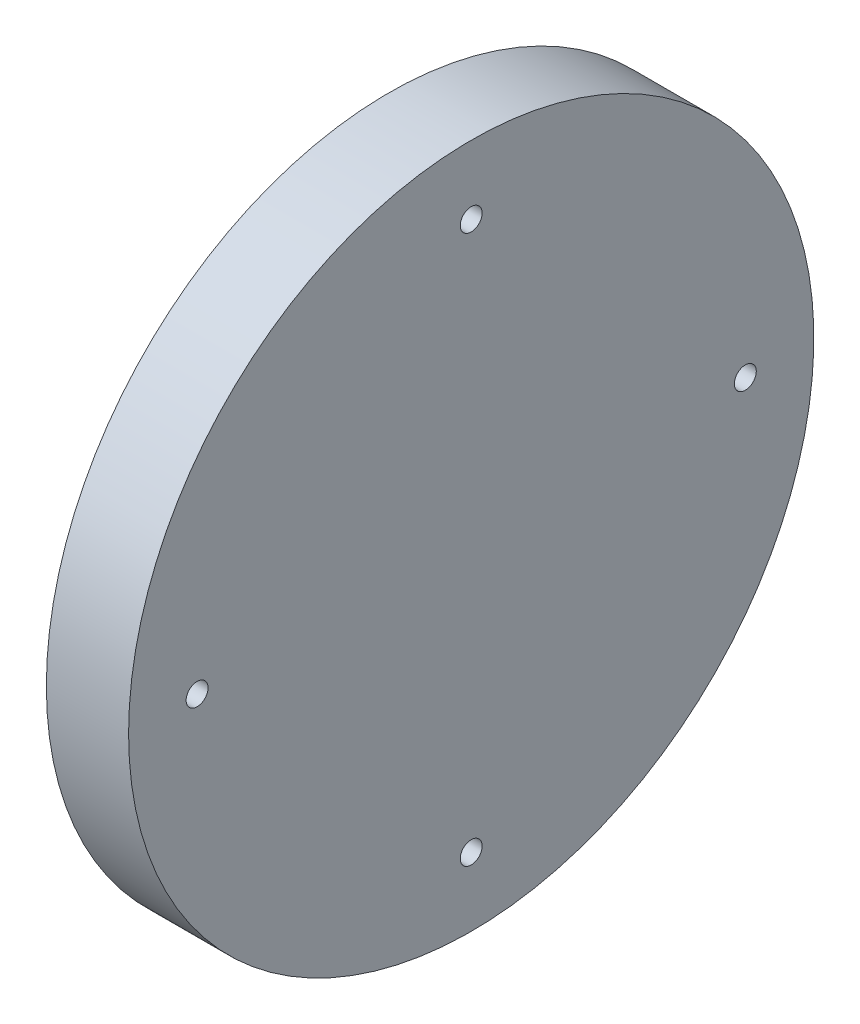
ISO-10303-21;
HEADER;
FILE_DESCRIPTION(('STEP AP214'),'2;1');
FILE_NAME('part.step','',(''),(''),'','','');
FILE_SCHEMA(('AUTOMOTIVE_DESIGN { 1 0 10303 214 1 1 1 1 }'));
ENDSEC;
DATA;
#1=APPLICATION_CONTEXT('core data for automotive mechanical design processes');
#2=APPLICATION_PROTOCOL_DEFINITION('international standard','automotive_design',2000,#1);
#3=PRODUCT_CONTEXT('',#1,'mechanical');
#4=PRODUCT('Part','Part','',(#3));
#5=PRODUCT_RELATED_PRODUCT_CATEGORY('part','',(#4));
#6=PRODUCT_DEFINITION_FORMATION('','',#4);
#7=PRODUCT_DEFINITION_CONTEXT('part definition',#1,'design');
#8=PRODUCT_DEFINITION('design','',#6,#7);
#9=PRODUCT_DEFINITION_SHAPE('','',#8);
#10=(LENGTH_UNIT() NAMED_UNIT(*) SI_UNIT(.MILLI.,.METRE.));
#11=(NAMED_UNIT(*) PLANE_ANGLE_UNIT() SI_UNIT($,.RADIAN.));
#12=(NAMED_UNIT(*) SI_UNIT($,.STERADIAN.) SOLID_ANGLE_UNIT());
#13=UNCERTAINTY_MEASURE_WITH_UNIT(LENGTH_MEASURE(1.E-05),#10,'distance_accuracy_value','');
#14=(GEOMETRIC_REPRESENTATION_CONTEXT(3) GLOBAL_UNCERTAINTY_ASSIGNED_CONTEXT((#13)) GLOBAL_UNIT_ASSIGNED_CONTEXT((#10,
#11,#12)) REPRESENTATION_CONTEXT('',''));
#15=CARTESIAN_POINT('',(0.,0.,0.));
#16=DIRECTION('',(0.,0.,1.));
#17=DIRECTION('',(1.,0.,0.));
#18=AXIS2_PLACEMENT_3D('',#15,#16,#17);
#19=CARTESIAN_POINT('',(11.,0.,0.));
#20=DIRECTION('',(-1.,0.,0.));
#21=DIRECTION('',(0.,0.,1.));
#22=AXIS2_PLACEMENT_3D('',#19,#20,#21);
#23=CYLINDRICAL_SURFACE('',#22,25.);
#24=CARTESIAN_POINT('',(11.,0.,0.));
#25=DIRECTION('',(-1.,0.,0.));
#26=DIRECTION('',(0.,0.,1.));
#27=AXIS2_PLACEMENT_3D('',#24,#25,#26);
#28=CIRCLE('',#27,25.);
#29=CARTESIAN_POINT('',(11.,0.,25.));
#30=VERTEX_POINT('',#29);
#31=EDGE_CURVE('E10',#30,#30,#28,.T.);
#32=ORIENTED_EDGE('',*,*,#31,.T.);
#33=EDGE_LOOP('',(#32));
#34=FACE_BOUND('',#33,.T.);
#35=CARTESIAN_POINT('',(5.,0.,0.));
#36=DIRECTION('',(-1.,0.,0.));
#37=DIRECTION('',(0.,0.,1.));
#38=AXIS2_PLACEMENT_3D('',#35,#36,#37);
#39=CIRCLE('',#38,25.);
#40=CARTESIAN_POINT('',(5.,0.,25.));
#41=VERTEX_POINT('',#40);
#42=EDGE_CURVE('E37',#41,#41,#39,.T.);
#43=ORIENTED_EDGE('',*,*,#42,.F.);
#44=EDGE_LOOP('',(#43));
#45=FACE_BOUND('',#44,.T.);
#46=ADVANCED_FACE('F31',(#34,#45),#23,.T.);
#47=CARTESIAN_POINT('',(11.,25.,0.));
#48=DIRECTION('',(1.,0.,0.));
#49=DIRECTION('',(0.,0.,-1.));
#50=AXIS2_PLACEMENT_3D('',#47,#48,#49);
#51=PLANE('',#50);
#52=CARTESIAN_POINT('',(11.,20.,0.));
#53=DIRECTION('',(-1.,0.,0.));
#54=DIRECTION('',(0.,0.,1.));
#55=AXIS2_PLACEMENT_3D('',#52,#53,#54);
#56=CIRCLE('',#55,0.799999999999985);
#57=CARTESIAN_POINT('',(11.,20.,0.799999999999985));
#58=VERTEX_POINT('',#57);
#59=EDGE_CURVE('E68',#58,#58,#56,.T.);
#60=ORIENTED_EDGE('',*,*,#59,.T.);
#61=EDGE_LOOP('',(#60));
#62=FACE_BOUND('',#61,.T.);
#63=CARTESIAN_POINT('',(11.,0.,-20.));
#64=DIRECTION('',(-1.,0.,0.));
#65=DIRECTION('',(0.,0.,1.));
#66=AXIS2_PLACEMENT_3D('',#63,#64,#65);
#67=CIRCLE('',#66,0.799999999999985);
#68=CARTESIAN_POINT('',(11.,0.,-19.2));
#69=VERTEX_POINT('',#68);
#70=EDGE_CURVE('E62',#69,#69,#67,.T.);
#71=ORIENTED_EDGE('',*,*,#70,.T.);
#72=EDGE_LOOP('',(#71));
#73=FACE_BOUND('',#72,.T.);
#74=CARTESIAN_POINT('',(11.,-20.,0.));
#75=DIRECTION('',(-1.,0.,0.));
#76=DIRECTION('',(0.,0.,1.));
#77=AXIS2_PLACEMENT_3D('',#74,#75,#76);
#78=CIRCLE('',#77,0.799999999999985);
#79=CARTESIAN_POINT('',(11.,-20.,0.799999999999985));
#80=VERTEX_POINT('',#79);
#81=EDGE_CURVE('E56',#80,#80,#78,.T.);
#82=ORIENTED_EDGE('',*,*,#81,.T.);
#83=EDGE_LOOP('',(#82));
#84=FACE_BOUND('',#83,.T.);
#85=CARTESIAN_POINT('',(11.,0.,20.));
#86=DIRECTION('',(-1.,0.,0.));
#87=DIRECTION('',(0.,0.,1.));
#88=AXIS2_PLACEMENT_3D('',#85,#86,#87);
#89=CIRCLE('',#88,0.799999999999985);
#90=CARTESIAN_POINT('',(11.,0.,20.8));
#91=VERTEX_POINT('',#90);
#92=EDGE_CURVE('E49',#91,#91,#89,.T.);
#93=ORIENTED_EDGE('',*,*,#92,.T.);
#94=EDGE_LOOP('',(#93));
#95=FACE_BOUND('',#94,.T.);
#96=ORIENTED_EDGE('',*,*,#31,.F.);
#97=EDGE_LOOP('',(#96));
#98=FACE_BOUND('',#97,.T.);
#99=ADVANCED_FACE('F81',(#62,#73,#84,#95,#98),#51,.T.);
#100=CARTESIAN_POINT('',(5.,0.,0.));
#101=DIRECTION('',(-1.,0.,0.));
#102=DIRECTION('',(0.,0.,1.));
#103=AXIS2_PLACEMENT_3D('',#100,#101,#102);
#104=PLANE('',#103);
#105=CARTESIAN_POINT('',(5.,20.,0.));
#106=DIRECTION('',(-1.,0.,0.));
#107=DIRECTION('',(0.,0.,1.));
#108=AXIS2_PLACEMENT_3D('',#105,#106,#107);
#109=CIRCLE('',#108,0.799999999999985);
#110=CARTESIAN_POINT('',(5.,20.,0.799999999999985));
#111=VERTEX_POINT('',#110);
#112=EDGE_CURVE('E71',#111,#111,#109,.T.);
#113=ORIENTED_EDGE('',*,*,#112,.F.);
#114=EDGE_LOOP('',(#113));
#115=FACE_BOUND('',#114,.T.);
#116=CARTESIAN_POINT('',(5.,0.,-20.));
#117=DIRECTION('',(-1.,0.,0.));
#118=DIRECTION('',(0.,0.,1.));
#119=AXIS2_PLACEMENT_3D('',#116,#117,#118);
#120=CIRCLE('',#119,0.799999999999986);
#121=CARTESIAN_POINT('',(5.,0.,-19.2));
#122=VERTEX_POINT('',#121);
#123=EDGE_CURVE('E65',#122,#122,#120,.T.);
#124=ORIENTED_EDGE('',*,*,#123,.F.);
#125=EDGE_LOOP('',(#124));
#126=FACE_BOUND('',#125,.T.);
#127=CARTESIAN_POINT('',(5.,-20.,0.));
#128=DIRECTION('',(-1.,0.,0.));
#129=DIRECTION('',(0.,0.,1.));
#130=AXIS2_PLACEMENT_3D('',#127,#128,#129);
#131=CIRCLE('',#130,0.799999999999985);
#132=CARTESIAN_POINT('',(5.,-20.,0.799999999999985));
#133=VERTEX_POINT('',#132);
#134=EDGE_CURVE('E59',#133,#133,#131,.T.);
#135=ORIENTED_EDGE('',*,*,#134,.F.);
#136=EDGE_LOOP('',(#135));
#137=FACE_BOUND('',#136,.T.);
#138=CARTESIAN_POINT('',(5.,0.,20.));
#139=DIRECTION('',(-1.,0.,0.));
#140=DIRECTION('',(0.,0.,1.));
#141=AXIS2_PLACEMENT_3D('',#138,#139,#140);
#142=CIRCLE('',#141,0.799999999999986);
#143=CARTESIAN_POINT('',(5.,0.,20.8));
#144=VERTEX_POINT('',#143);
#145=EDGE_CURVE('E53',#144,#144,#142,.T.);
#146=ORIENTED_EDGE('',*,*,#145,.F.);
#147=EDGE_LOOP('',(#146));
#148=FACE_BOUND('',#147,.T.);
#149=CARTESIAN_POINT('',(5.,0.,0.));
#150=DIRECTION('',(-1.,0.,0.));
#151=DIRECTION('',(0.,0.,1.));
#152=AXIS2_PLACEMENT_3D('',#149,#150,#151);
#153=CIRCLE('',#152,9.5);
#154=CARTESIAN_POINT('',(5.,0.,9.5));
#155=VERTEX_POINT('',#154);
#156=EDGE_CURVE('E45',#155,#155,#153,.T.);
#157=ORIENTED_EDGE('',*,*,#156,.F.);
#158=EDGE_LOOP('',(#157));
#159=FACE_BOUND('',#158,.T.);
#160=ORIENTED_EDGE('',*,*,#42,.T.);
#161=EDGE_LOOP('',(#160));
#162=FACE_BOUND('',#161,.T.);
#163=ADVANCED_FACE('F77',(#115,#126,#137,#148,#159,#162),#104,.T.);
#164=CARTESIAN_POINT('',(0.,0.,0.));
#165=DIRECTION('',(1.,0.,0.));
#166=DIRECTION('',(0.,0.,-1.));
#167=AXIS2_PLACEMENT_3D('',#164,#165,#166);
#168=CYLINDRICAL_SURFACE('',#167,9.5);
#169=CARTESIAN_POINT('',(0.,0.,0.));
#170=DIRECTION('',(-1.,0.,0.));
#171=DIRECTION('',(0.,0.,1.));
#172=AXIS2_PLACEMENT_3D('',#169,#170,#171);
#173=CIRCLE('',#172,9.5);
#174=CARTESIAN_POINT('',(0.,0.,9.5));
#175=VERTEX_POINT('',#174);
#176=EDGE_CURVE('E41',#175,#175,#173,.T.);
#177=ORIENTED_EDGE('',*,*,#176,.F.);
#178=EDGE_LOOP('',(#177));
#179=FACE_BOUND('',#178,.T.);
#180=ORIENTED_EDGE('',*,*,#156,.T.);
#181=EDGE_LOOP('',(#180));
#182=FACE_BOUND('',#181,.T.);
#183=ADVANCED_FACE('F80',(#179,#182),#168,.T.);
#184=CARTESIAN_POINT('',(0.,0.,0.));
#185=DIRECTION('',(-1.,0.,0.));
#186=DIRECTION('',(0.,0.,1.));
#187=AXIS2_PLACEMENT_3D('',#184,#185,#186);
#188=PLANE('',#187);
#189=ORIENTED_EDGE('',*,*,#176,.T.);
#190=EDGE_LOOP('',(#189));
#191=FACE_BOUND('',#190,.T.);
#192=ADVANCED_FACE('F92',(#191),#188,.T.);
#193=CARTESIAN_POINT('',(5.,0.,20.));
#194=DIRECTION('',(-1.,0.,0.));
#195=DIRECTION('',(0.,0.,1.));
#196=AXIS2_PLACEMENT_3D('',#193,#194,#195);
#197=CYLINDRICAL_SURFACE('',#196,0.799999999999986);
#198=ORIENTED_EDGE('',*,*,#92,.F.);
#199=EDGE_LOOP('',(#198));
#200=FACE_BOUND('',#199,.T.);
#201=ORIENTED_EDGE('',*,*,#145,.T.);
#202=EDGE_LOOP('',(#201));
#203=FACE_BOUND('',#202,.T.);
#204=ADVANCED_FACE('F98',(#200,#203),#197,.F.);
#205=CARTESIAN_POINT('',(5.,-20.,0.));
#206=DIRECTION('',(-1.,0.,0.));
#207=DIRECTION('',(0.,0.,1.));
#208=AXIS2_PLACEMENT_3D('',#205,#206,#207);
#209=CYLINDRICAL_SURFACE('',#208,0.799999999999985);
#210=ORIENTED_EDGE('',*,*,#81,.F.);
#211=EDGE_LOOP('',(#210));
#212=FACE_BOUND('',#211,.T.);
#213=ORIENTED_EDGE('',*,*,#134,.T.);
#214=EDGE_LOOP('',(#213));
#215=FACE_BOUND('',#214,.T.);
#216=ADVANCED_FACE('F121',(#212,#215),#209,.F.);
#217=CARTESIAN_POINT('',(5.,0.,-20.));
#218=DIRECTION('',(-1.,0.,0.));
#219=DIRECTION('',(0.,0.,1.));
#220=AXIS2_PLACEMENT_3D('',#217,#218,#219);
#221=CYLINDRICAL_SURFACE('',#220,0.799999999999986);
#222=ORIENTED_EDGE('',*,*,#70,.F.);
#223=EDGE_LOOP('',(#222));
#224=FACE_BOUND('',#223,.T.);
#225=ORIENTED_EDGE('',*,*,#123,.T.);
#226=EDGE_LOOP('',(#225));
#227=FACE_BOUND('',#226,.T.);
#228=ADVANCED_FACE('F126',(#224,#227),#221,.F.);
#229=CARTESIAN_POINT('',(5.,20.,0.));
#230=DIRECTION('',(-1.,0.,0.));
#231=DIRECTION('',(0.,0.,1.));
#232=AXIS2_PLACEMENT_3D('',#229,#230,#231);
#233=CYLINDRICAL_SURFACE('',#232,0.799999999999985);
#234=ORIENTED_EDGE('',*,*,#59,.F.);
#235=EDGE_LOOP('',(#234));
#236=FACE_BOUND('',#235,.T.);
#237=ORIENTED_EDGE('',*,*,#112,.T.);
#238=EDGE_LOOP('',(#237));
#239=FACE_BOUND('',#238,.T.);
#240=ADVANCED_FACE('F75',(#236,#239),#233,.F.);
#241=CLOSED_SHELL('',(#46,#99,#163,#183,#192,#204,#216,#228,#240));
#242=MANIFOLD_SOLID_BREP('B2',#241);
#243=ADVANCED_BREP_SHAPE_REPRESENTATION('',(#18,#242),#14);
#244=SHAPE_DEFINITION_REPRESENTATION(#9,#243);
ENDSEC;
END-ISO-10303-21;
